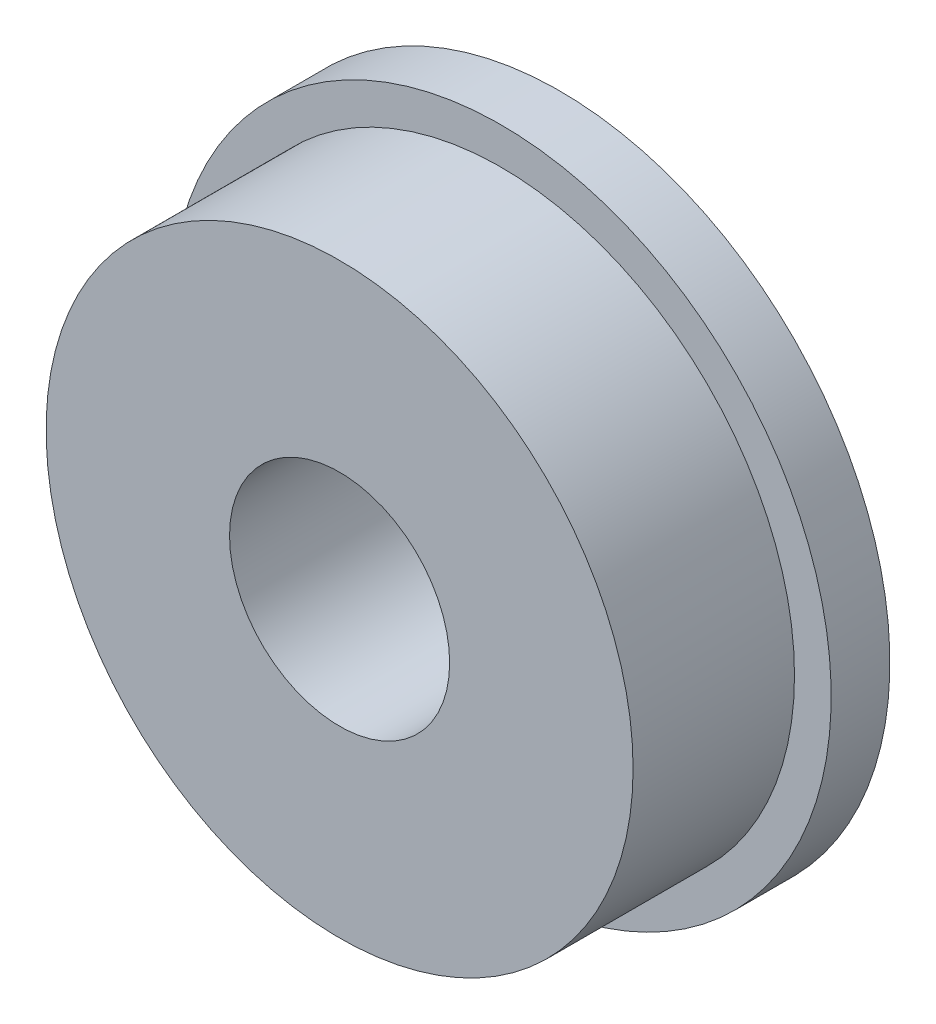
ISO-10303-21;
HEADER;
FILE_DESCRIPTION(('STEP AP214'),'2;1');
FILE_NAME('part.step','',(''),(''),'','','');
FILE_SCHEMA(('AUTOMOTIVE_DESIGN { 1 0 10303 214 1 1 1 1 }'));
ENDSEC;
DATA;
#1=APPLICATION_CONTEXT('core data for automotive mechanical design processes');
#2=APPLICATION_PROTOCOL_DEFINITION('international standard','automotive_design',2000,#1);
#3=PRODUCT_CONTEXT('',#1,'mechanical');
#4=PRODUCT('Part','Part','',(#3));
#5=PRODUCT_RELATED_PRODUCT_CATEGORY('part','',(#4));
#6=PRODUCT_DEFINITION_FORMATION('','',#4);
#7=PRODUCT_DEFINITION_CONTEXT('part definition',#1,'design');
#8=PRODUCT_DEFINITION('design','',#6,#7);
#9=PRODUCT_DEFINITION_SHAPE('','',#8);
#10=(LENGTH_UNIT() NAMED_UNIT(*) SI_UNIT(.MILLI.,.METRE.));
#11=(NAMED_UNIT(*) PLANE_ANGLE_UNIT() SI_UNIT($,.RADIAN.));
#12=(NAMED_UNIT(*) SI_UNIT($,.STERADIAN.) SOLID_ANGLE_UNIT());
#13=UNCERTAINTY_MEASURE_WITH_UNIT(LENGTH_MEASURE(1.E-05),#10,'distance_accuracy_value','');
#14=(GEOMETRIC_REPRESENTATION_CONTEXT(3) GLOBAL_UNCERTAINTY_ASSIGNED_CONTEXT((#13)) GLOBAL_UNIT_ASSIGNED_CONTEXT((#10,
#11,#12)) REPRESENTATION_CONTEXT('',''));
#15=CARTESIAN_POINT('',(0.,0.,0.));
#16=DIRECTION('',(0.,0.,1.));
#17=DIRECTION('',(1.,0.,0.));
#18=AXIS2_PLACEMENT_3D('',#15,#16,#17);
#19=CARTESIAN_POINT('',(0.,0.,2.2));
#20=DIRECTION('',(0.,0.,-1.));
#21=DIRECTION('',(-1.,0.,0.));
#22=AXIS2_PLACEMENT_3D('',#19,#20,#21);
#23=CYLINDRICAL_SURFACE('',#22,4.);
#24=CARTESIAN_POINT('',(0.,0.,2.2));
#25=DIRECTION('',(0.,0.,1.));
#26=DIRECTION('',(1.,0.,0.));
#27=AXIS2_PLACEMENT_3D('',#24,#25,#26);
#28=CIRCLE('',#27,4.);
#29=CARTESIAN_POINT('',(4.,0.,2.2));
#30=VERTEX_POINT('',#29);
#31=EDGE_CURVE('E10',#30,#30,#28,.T.);
#32=ORIENTED_EDGE('',*,*,#31,.F.);
#33=EDGE_LOOP('',(#32));
#34=FACE_BOUND('',#33,.T.);
#35=CARTESIAN_POINT('',(0.,0.,0.));
#36=DIRECTION('',(0.,0.,1.));
#37=DIRECTION('',(1.,0.,0.));
#38=AXIS2_PLACEMENT_3D('',#35,#36,#37);
#39=CIRCLE('',#38,4.);
#40=CARTESIAN_POINT('',(4.,0.,0.));
#41=VERTEX_POINT('',#40);
#42=EDGE_CURVE('E37',#41,#41,#39,.T.);
#43=ORIENTED_EDGE('',*,*,#42,.T.);
#44=EDGE_LOOP('',(#43));
#45=FACE_BOUND('',#44,.T.);
#46=ADVANCED_FACE('F34',(#34,#45),#23,.T.);
#47=CARTESIAN_POINT('',(0.,0.,2.2));
#48=DIRECTION('',(0.,0.,1.));
#49=DIRECTION('',(1.,0.,0.));
#50=AXIS2_PLACEMENT_3D('',#47,#48,#49);
#51=PLANE('',#50);
#52=CARTESIAN_POINT('',(0.,0.,2.2));
#53=DIRECTION('',(0.,0.,1.));
#54=DIRECTION('',(1.,0.,0.));
#55=AXIS2_PLACEMENT_3D('',#52,#53,#54);
#56=CIRCLE('',#55,1.5);
#57=CARTESIAN_POINT('',(1.5,0.,2.2));
#58=VERTEX_POINT('',#57);
#59=EDGE_CURVE('E41',#58,#58,#56,.T.);
#60=ORIENTED_EDGE('',*,*,#59,.F.);
#61=EDGE_LOOP('',(#60));
#62=FACE_BOUND('',#61,.T.);
#63=ORIENTED_EDGE('',*,*,#31,.T.);
#64=EDGE_LOOP('',(#63));
#65=FACE_BOUND('',#64,.T.);
#66=ADVANCED_FACE('F63',(#62,#65),#51,.T.);
#67=CARTESIAN_POINT('',(0.,0.,-4.8));
#68=DIRECTION('',(0.,0.,1.));
#69=DIRECTION('',(1.,0.,0.));
#70=AXIS2_PLACEMENT_3D('',#67,#68,#69);
#71=CYLINDRICAL_SURFACE('',#70,1.5);
#72=ORIENTED_EDGE('',*,*,#59,.T.);
#73=EDGE_LOOP('',(#72));
#74=FACE_BOUND('',#73,.T.);
#75=CARTESIAN_POINT('',(0.,0.,-0.8));
#76=DIRECTION('',(0.,0.,1.));
#77=DIRECTION('',(1.,0.,0.));
#78=AXIS2_PLACEMENT_3D('',#75,#76,#77);
#79=CIRCLE('',#78,1.5);
#80=CARTESIAN_POINT('',(1.5,0.,-0.8));
#81=VERTEX_POINT('',#80);
#82=EDGE_CURVE('E51',#81,#81,#79,.T.);
#83=ORIENTED_EDGE('',*,*,#82,.F.);
#84=EDGE_LOOP('',(#83));
#85=FACE_BOUND('',#84,.T.);
#86=ADVANCED_FACE('F60',(#74,#85),#71,.F.);
#87=CARTESIAN_POINT('',(0.,0.,0.));
#88=DIRECTION('',(0.,0.,-1.));
#89=DIRECTION('',(-1.,0.,0.));
#90=AXIS2_PLACEMENT_3D('',#87,#88,#89);
#91=PLANE('',#90);
#92=ORIENTED_EDGE('',*,*,#42,.F.);
#93=EDGE_LOOP('',(#92));
#94=FACE_BOUND('',#93,.T.);
#95=CARTESIAN_POINT('',(0.,0.,0.));
#96=DIRECTION('',(0.,0.,-1.));
#97=DIRECTION('',(-1.,0.,0.));
#98=AXIS2_PLACEMENT_3D('',#95,#96,#97);
#99=CIRCLE('',#98,4.5);
#100=CARTESIAN_POINT('',(-4.5,0.,0.));
#101=VERTEX_POINT('',#100);
#102=EDGE_CURVE('E47',#101,#101,#99,.T.);
#103=ORIENTED_EDGE('',*,*,#102,.F.);
#104=EDGE_LOOP('',(#103));
#105=FACE_BOUND('',#104,.T.);
#106=ADVANCED_FACE('F62',(#94,#105),#91,.F.);
#107=CARTESIAN_POINT('',(0.,0.,-0.8));
#108=DIRECTION('',(0.,0.,-1.));
#109=DIRECTION('',(-1.,0.,0.));
#110=AXIS2_PLACEMENT_3D('',#107,#108,#109);
#111=PLANE('',#110);
#112=ORIENTED_EDGE('',*,*,#82,.T.);
#113=EDGE_LOOP('',(#112));
#114=FACE_BOUND('',#113,.T.);
#115=CARTESIAN_POINT('',(0.,0.,-0.8));
#116=DIRECTION('',(0.,0.,-1.));
#117=DIRECTION('',(-1.,0.,0.));
#118=AXIS2_PLACEMENT_3D('',#115,#116,#117);
#119=CIRCLE('',#118,4.5);
#120=CARTESIAN_POINT('',(-4.5,0.,-0.8));
#121=VERTEX_POINT('',#120);
#122=EDGE_CURVE('E50',#121,#121,#119,.T.);
#123=ORIENTED_EDGE('',*,*,#122,.T.);
#124=EDGE_LOOP('',(#123));
#125=FACE_BOUND('',#124,.T.);
#126=ADVANCED_FACE('F57',(#114,#125),#111,.T.);
#127=CARTESIAN_POINT('',(0.,0.,-0.8));
#128=DIRECTION('',(0.,0.,1.));
#129=DIRECTION('',(1.,0.,0.));
#130=AXIS2_PLACEMENT_3D('',#127,#128,#129);
#131=CYLINDRICAL_SURFACE('',#130,4.5);
#132=ORIENTED_EDGE('',*,*,#122,.F.);
#133=EDGE_LOOP('',(#132));
#134=FACE_BOUND('',#133,.T.);
#135=ORIENTED_EDGE('',*,*,#102,.T.);
#136=EDGE_LOOP('',(#135));
#137=FACE_BOUND('',#136,.T.);
#138=ADVANCED_FACE('F84',(#134,#137),#131,.T.);
#139=CLOSED_SHELL('',(#46,#66,#86,#106,#126,#138));
#140=MANIFOLD_SOLID_BREP('B2',#139);
#141=ADVANCED_BREP_SHAPE_REPRESENTATION('',(#18,#140),#14);
#142=SHAPE_DEFINITION_REPRESENTATION(#9,#141);
ENDSEC;
END-ISO-10303-21;
